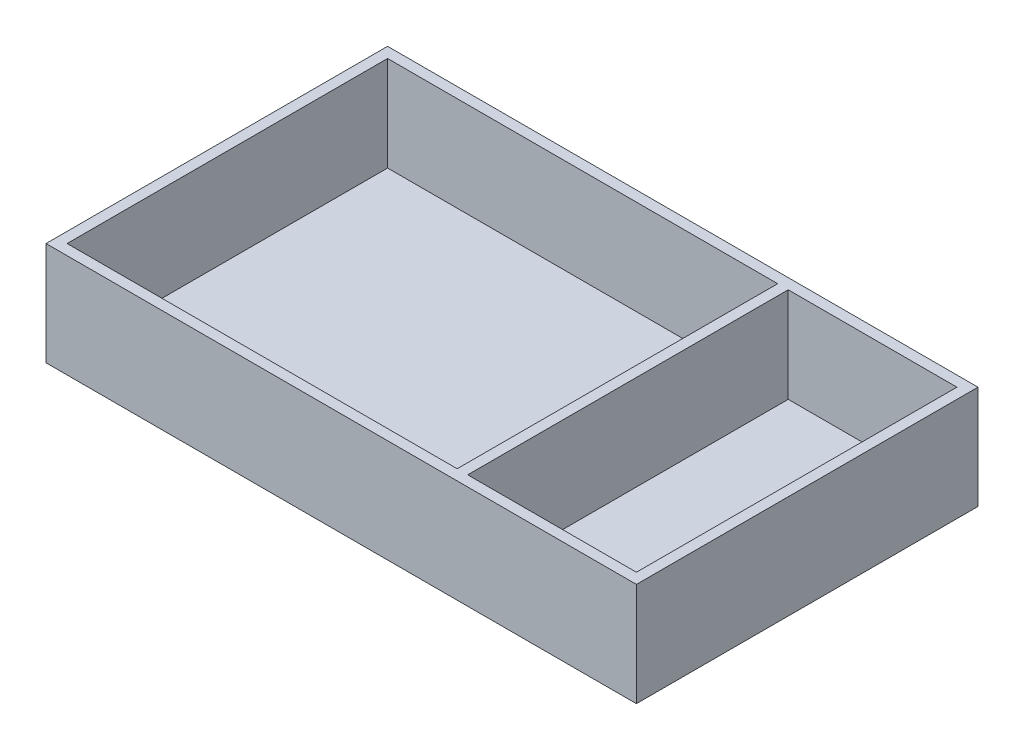
ISO-10303-21;
HEADER;
FILE_DESCRIPTION(('STEP AP214'),'2;1');
FILE_NAME('part.step','',(''),(''),'','','');
FILE_SCHEMA(('AUTOMOTIVE_DESIGN { 1 0 10303 214 1 1 1 1 }'));
ENDSEC;
DATA;
#1=APPLICATION_CONTEXT('core data for automotive mechanical design processes');
#2=APPLICATION_PROTOCOL_DEFINITION('international standard','automotive_design',2000,#1);
#3=PRODUCT_CONTEXT('',#1,'mechanical');
#4=PRODUCT('Part','Part','',(#3));
#5=PRODUCT_RELATED_PRODUCT_CATEGORY('part','',(#4));
#6=PRODUCT_DEFINITION_FORMATION('','',#4);
#7=PRODUCT_DEFINITION_CONTEXT('part definition',#1,'design');
#8=PRODUCT_DEFINITION('design','',#6,#7);
#9=PRODUCT_DEFINITION_SHAPE('','',#8);
#10=(LENGTH_UNIT() NAMED_UNIT(*) SI_UNIT(.MILLI.,.METRE.));
#11=(NAMED_UNIT(*) PLANE_ANGLE_UNIT() SI_UNIT($,.RADIAN.));
#12=(NAMED_UNIT(*) SI_UNIT($,.STERADIAN.) SOLID_ANGLE_UNIT());
#13=UNCERTAINTY_MEASURE_WITH_UNIT(LENGTH_MEASURE(1.E-05),#10,'distance_accuracy_value','');
#14=(GEOMETRIC_REPRESENTATION_CONTEXT(3) GLOBAL_UNCERTAINTY_ASSIGNED_CONTEXT((#13)) GLOBAL_UNIT_ASSIGNED_CONTEXT((#10,
#11,#12)) REPRESENTATION_CONTEXT('',''));
#15=CARTESIAN_POINT('',(0.,0.,0.));
#16=DIRECTION('',(0.,0.,1.));
#17=DIRECTION('',(1.,0.,0.));
#18=AXIS2_PLACEMENT_3D('',#15,#16,#17);
#19=CARTESIAN_POINT('',(-135.,45.,-76.));
#20=DIRECTION('',(0.,0.,1.));
#21=DIRECTION('',(1.,0.,0.));
#22=AXIS2_PLACEMENT_3D('',#19,#20,#21);
#23=PLANE('',#22);
#24=DIRECTION('',(-1.,0.,0.));
#25=VECTOR('',#24,1.);
#26=CARTESIAN_POINT('',(-135.,45.,-76.));
#27=LINE('',#26,#25);
#28=CARTESIAN_POINT('',(135.,45.,-76.));
#29=VERTEX_POINT('',#28);
#30=CARTESIAN_POINT('',(55.,45.,-76.));
#31=VERTEX_POINT('',#30);
#32=EDGE_CURVE('E67',#29,#31,#27,.T.);
#33=ORIENTED_EDGE('',*,*,#32,.T.);
#34=DIRECTION('',(0.,-1.,0.));
#35=VECTOR('',#34,1.);
#36=CARTESIAN_POINT('',(55.,45.,-76.));
#37=LINE('',#36,#35);
#38=CARTESIAN_POINT('',(55.,0.,-76.));
#39=VERTEX_POINT('',#38);
#40=EDGE_CURVE('E175',#31,#39,#37,.T.);
#41=ORIENTED_EDGE('',*,*,#40,.T.);
#42=DIRECTION('',(-1.,0.,0.));
#43=VECTOR('',#42,1.);
#44=CARTESIAN_POINT('',(-135.,0.,-76.));
#45=LINE('',#44,#43);
#46=CARTESIAN_POINT('',(135.,0.,-76.));
#47=VERTEX_POINT('',#46);
#48=EDGE_CURVE('E212',#47,#39,#45,.T.);
#49=ORIENTED_EDGE('',*,*,#48,.F.);
#50=DIRECTION('',(0.,-1.,0.));
#51=VECTOR('',#50,1.);
#52=CARTESIAN_POINT('',(135.,45.,-76.));
#53=LINE('',#52,#51);
#54=EDGE_CURVE('E228',#29,#47,#53,.T.);
#55=ORIENTED_EDGE('',*,*,#54,.F.);
#56=EDGE_LOOP('',(#33,#41,#49,#55));
#57=FACE_BOUND('',#56,.T.);
#58=ADVANCED_FACE('F43',(#57),#23,.T.);
#59=CARTESIAN_POINT('',(50.,0.,-76.));
#60=VERTEX_POINT('',#59);
#61=CARTESIAN_POINT('',(-135.,0.,-76.));
#62=VERTEX_POINT('',#61);
#63=EDGE_CURVE('E211',#60,#62,#45,.T.);
#64=ORIENTED_EDGE('',*,*,#63,.F.);
#65=DIRECTION('',(0.,-1.,0.));
#66=VECTOR('',#65,1.);
#67=CARTESIAN_POINT('',(50.,45.,-76.));
#68=LINE('',#67,#66);
#69=CARTESIAN_POINT('',(50.,45.,-76.));
#70=VERTEX_POINT('',#69);
#71=EDGE_CURVE('E59',#70,#60,#68,.T.);
#72=ORIENTED_EDGE('',*,*,#71,.F.);
#73=CARTESIAN_POINT('',(-135.,45.,-76.));
#74=VERTEX_POINT('',#73);
#75=EDGE_CURVE('E197',#70,#74,#27,.T.);
#76=ORIENTED_EDGE('',*,*,#75,.T.);
#77=DIRECTION('',(0.,-1.,0.));
#78=VECTOR('',#77,1.);
#79=CARTESIAN_POINT('',(-135.,45.,-76.));
#80=LINE('',#79,#78);
#81=EDGE_CURVE('E224',#74,#62,#80,.T.);
#82=ORIENTED_EDGE('',*,*,#81,.T.);
#83=EDGE_LOOP('',(#64,#72,#76,#82));
#84=FACE_BOUND('',#83,.T.);
#85=ADVANCED_FACE('F282',(#84),#23,.T.);
#86=CARTESIAN_POINT('',(-135.,45.,76.));
#87=DIRECTION('',(0.,0.,-1.));
#88=DIRECTION('',(-1.,0.,0.));
#89=AXIS2_PLACEMENT_3D('',#86,#87,#88);
#90=PLANE('',#89);
#91=DIRECTION('',(1.,0.,0.));
#92=VECTOR('',#91,1.);
#93=CARTESIAN_POINT('',(-135.,0.,76.));
#94=LINE('',#93,#92);
#95=CARTESIAN_POINT('',(55.,0.,76.));
#96=VERTEX_POINT('',#95);
#97=CARTESIAN_POINT('',(135.,0.,76.));
#98=VERTEX_POINT('',#97);
#99=EDGE_CURVE('E144',#96,#98,#94,.T.);
#100=ORIENTED_EDGE('',*,*,#99,.F.);
#101=DIRECTION('',(0.,-1.,0.));
#102=VECTOR('',#101,1.);
#103=CARTESIAN_POINT('',(55.,45.,76.));
#104=LINE('',#103,#102);
#105=CARTESIAN_POINT('',(55.,45.,76.));
#106=VERTEX_POINT('',#105);
#107=EDGE_CURVE('E155',#106,#96,#104,.T.);
#108=ORIENTED_EDGE('',*,*,#107,.F.);
#109=DIRECTION('',(1.,0.,0.));
#110=VECTOR('',#109,1.);
#111=CARTESIAN_POINT('',(-135.,45.,76.));
#112=LINE('',#111,#110);
#113=CARTESIAN_POINT('',(135.,45.,76.));
#114=VERTEX_POINT('',#113);
#115=EDGE_CURVE('E204',#106,#114,#112,.T.);
#116=ORIENTED_EDGE('',*,*,#115,.T.);
#117=DIRECTION('',(0.,-1.,0.));
#118=VECTOR('',#117,1.);
#119=CARTESIAN_POINT('',(135.,45.,76.));
#120=LINE('',#119,#118);
#121=EDGE_CURVE('E207',#114,#98,#120,.T.);
#122=ORIENTED_EDGE('',*,*,#121,.T.);
#123=EDGE_LOOP('',(#100,#108,#116,#122));
#124=FACE_BOUND('',#123,.T.);
#125=ADVANCED_FACE('F287',(#124),#90,.T.);
#126=CARTESIAN_POINT('',(-135.,45.,76.));
#127=VERTEX_POINT('',#126);
#128=CARTESIAN_POINT('',(50.,45.,76.));
#129=VERTEX_POINT('',#128);
#130=EDGE_CURVE('E150',#127,#129,#112,.T.);
#131=ORIENTED_EDGE('',*,*,#130,.T.);
#132=DIRECTION('',(0.,-1.,0.));
#133=VECTOR('',#132,1.);
#134=CARTESIAN_POINT('',(50.,45.,76.));
#135=LINE('',#134,#133);
#136=CARTESIAN_POINT('',(50.,0.,76.));
#137=VERTEX_POINT('',#136);
#138=EDGE_CURVE('E147',#129,#137,#135,.T.);
#139=ORIENTED_EDGE('',*,*,#138,.T.);
#140=CARTESIAN_POINT('',(-135.,0.,76.));
#141=VERTEX_POINT('',#140);
#142=EDGE_CURVE('E133',#141,#137,#94,.T.);
#143=ORIENTED_EDGE('',*,*,#142,.F.);
#144=DIRECTION('',(0.,-1.,0.));
#145=VECTOR('',#144,1.);
#146=CARTESIAN_POINT('',(-135.,45.,76.));
#147=LINE('',#146,#145);
#148=EDGE_CURVE('E221',#127,#141,#147,.T.);
#149=ORIENTED_EDGE('',*,*,#148,.F.);
#150=EDGE_LOOP('',(#131,#139,#143,#149));
#151=FACE_BOUND('',#150,.T.);
#152=ADVANCED_FACE('F148',(#151),#90,.T.);
#153=CARTESIAN_POINT('',(0.,0.,0.));
#154=DIRECTION('',(0.,-1.,0.));
#155=DIRECTION('',(0.,0.,-1.));
#156=AXIS2_PLACEMENT_3D('',#153,#154,#155);
#157=PLANE('',#156);
#158=DIRECTION('',(0.,0.,-1.));
#159=VECTOR('',#158,1.);
#160=CARTESIAN_POINT('',(55.,0.,-76.));
#161=LINE('',#160,#159);
#162=EDGE_CURVE('E160',#96,#39,#161,.T.);
#163=ORIENTED_EDGE('',*,*,#162,.F.);
#164=ORIENTED_EDGE('',*,*,#99,.T.);
#165=DIRECTION('',(0.,0.,-1.));
#166=VECTOR('',#165,1.);
#167=CARTESIAN_POINT('',(135.,0.,76.));
#168=LINE('',#167,#166);
#169=EDGE_CURVE('E194',#98,#47,#168,.T.);
#170=ORIENTED_EDGE('',*,*,#169,.T.);
#171=ORIENTED_EDGE('',*,*,#48,.T.);
#172=EDGE_LOOP('',(#163,#164,#170,#171));
#173=FACE_BOUND('',#172,.T.);
#174=ADVANCED_FACE('F383',(#173),#157,.F.);
#175=DIRECTION('',(0.,0.,1.));
#176=VECTOR('',#175,1.);
#177=CARTESIAN_POINT('',(50.,0.,-76.));
#178=LINE('',#177,#176);
#179=EDGE_CURVE('E137',#60,#137,#178,.T.);
#180=ORIENTED_EDGE('',*,*,#179,.F.);
#181=ORIENTED_EDGE('',*,*,#63,.T.);
#182=DIRECTION('',(0.,0.,1.));
#183=VECTOR('',#182,1.);
#184=CARTESIAN_POINT('',(-135.,0.,76.));
#185=LINE('',#184,#183);
#186=EDGE_CURVE('E139',#62,#141,#185,.T.);
#187=ORIENTED_EDGE('',*,*,#186,.T.);
#188=ORIENTED_EDGE('',*,*,#142,.T.);
#189=EDGE_LOOP('',(#180,#181,#187,#188));
#190=FACE_BOUND('',#189,.T.);
#191=ADVANCED_FACE('F135',(#190),#157,.F.);
#192=CARTESIAN_POINT('',(0.,45.,0.));
#193=DIRECTION('',(0.,-1.,0.));
#194=DIRECTION('',(0.,0.,-1.));
#195=AXIS2_PLACEMENT_3D('',#192,#193,#194);
#196=PLANE('',#195);
#197=ORIENTED_EDGE('',*,*,#75,.F.);
#198=DIRECTION('',(0.,0.,1.));
#199=VECTOR('',#198,1.);
#200=CARTESIAN_POINT('',(50.,45.,-76.));
#201=LINE('',#200,#199);
#202=EDGE_CURVE('E164',#70,#129,#201,.T.);
#203=ORIENTED_EDGE('',*,*,#202,.T.);
#204=ORIENTED_EDGE('',*,*,#130,.F.);
#205=DIRECTION('',(0.,0.,1.));
#206=VECTOR('',#205,1.);
#207=CARTESIAN_POINT('',(-135.,45.,76.));
#208=LINE('',#207,#206);
#209=EDGE_CURVE('E200',#74,#127,#208,.T.);
#210=ORIENTED_EDGE('',*,*,#209,.F.);
#211=EDGE_LOOP('',(#197,#203,#204,#210));
#212=FACE_BOUND('',#211,.T.);
#213=DIRECTION('',(0.,0.,-1.));
#214=VECTOR('',#213,1.);
#215=CARTESIAN_POINT('',(140.,45.,81.));
#216=LINE('',#215,#214);
#217=CARTESIAN_POINT('',(140.,45.,81.));
#218=VERTEX_POINT('',#217);
#219=CARTESIAN_POINT('',(140.,45.,-81.));
#220=VERTEX_POINT('',#219);
#221=EDGE_CURVE('E232',#218,#220,#216,.T.);
#222=ORIENTED_EDGE('',*,*,#221,.T.);
#223=DIRECTION('',(-1.,0.,0.));
#224=VECTOR('',#223,1.);
#225=CARTESIAN_POINT('',(-140.,45.,-81.));
#226=LINE('',#225,#224);
#227=CARTESIAN_POINT('',(-140.,45.,-81.));
#228=VERTEX_POINT('',#227);
#229=EDGE_CURVE('E236',#220,#228,#226,.T.);
#230=ORIENTED_EDGE('',*,*,#229,.T.);
#231=DIRECTION('',(0.,0.,1.));
#232=VECTOR('',#231,1.);
#233=CARTESIAN_POINT('',(-140.,45.,81.));
#234=LINE('',#233,#232);
#235=CARTESIAN_POINT('',(-140.,45.,81.));
#236=VERTEX_POINT('',#235);
#237=EDGE_CURVE('E239',#228,#236,#234,.T.);
#238=ORIENTED_EDGE('',*,*,#237,.T.);
#239=DIRECTION('',(1.,0.,0.));
#240=VECTOR('',#239,1.);
#241=CARTESIAN_POINT('',(-140.,45.,81.));
#242=LINE('',#241,#240);
#243=EDGE_CURVE('E242',#236,#218,#242,.T.);
#244=ORIENTED_EDGE('',*,*,#243,.T.);
#245=EDGE_LOOP('',(#222,#230,#238,#244));
#246=FACE_BOUND('',#245,.T.);
#247=DIRECTION('',(0.,0.,-1.));
#248=VECTOR('',#247,1.);
#249=CARTESIAN_POINT('',(135.,45.,76.));
#250=LINE('',#249,#248);
#251=EDGE_CURVE('E143',#114,#29,#250,.T.);
#252=ORIENTED_EDGE('',*,*,#251,.F.);
#253=ORIENTED_EDGE('',*,*,#115,.F.);
#254=DIRECTION('',(0.,0.,-1.));
#255=VECTOR('',#254,1.);
#256=CARTESIAN_POINT('',(55.,45.,-76.));
#257=LINE('',#256,#255);
#258=EDGE_CURVE('E159',#106,#31,#257,.T.);
#259=ORIENTED_EDGE('',*,*,#258,.T.);
#260=ORIENTED_EDGE('',*,*,#32,.F.);
#261=EDGE_LOOP('',(#252,#253,#259,#260));
#262=FACE_BOUND('',#261,.T.);
#263=ADVANCED_FACE('F271',(#212,#246,#262),#196,.F.);
#264=CARTESIAN_POINT('',(140.,45.,81.));
#265=DIRECTION('',(-1.,0.,0.));
#266=DIRECTION('',(0.,0.,1.));
#267=AXIS2_PLACEMENT_3D('',#264,#265,#266);
#268=PLANE('',#267);
#269=DIRECTION('',(0.,-1.,0.));
#270=VECTOR('',#269,1.);
#271=CARTESIAN_POINT('',(140.,45.,81.));
#272=LINE('',#271,#270);
#273=CARTESIAN_POINT('',(140.,-4.,81.));
#274=VERTEX_POINT('',#273);
#275=EDGE_CURVE('E245',#218,#274,#272,.T.);
#276=ORIENTED_EDGE('',*,*,#275,.T.);
#277=DIRECTION('',(0.,0.,1.));
#278=VECTOR('',#277,1.);
#279=CARTESIAN_POINT('',(140.,-4.,81.));
#280=LINE('',#279,#278);
#281=CARTESIAN_POINT('',(140.,-4.,-81.));
#282=VERTEX_POINT('',#281);
#283=EDGE_CURVE('E186',#282,#274,#280,.T.);
#284=ORIENTED_EDGE('',*,*,#283,.F.);
#285=DIRECTION('',(0.,-1.,0.));
#286=VECTOR('',#285,1.);
#287=CARTESIAN_POINT('',(140.,45.,-81.));
#288=LINE('',#287,#286);
#289=EDGE_CURVE('E11',#220,#282,#288,.T.);
#290=ORIENTED_EDGE('',*,*,#289,.F.);
#291=ORIENTED_EDGE('',*,*,#221,.F.);
#292=EDGE_LOOP('',(#276,#284,#290,#291));
#293=FACE_BOUND('',#292,.T.);
#294=ADVANCED_FACE('F45',(#293),#268,.F.);
#295=CARTESIAN_POINT('',(-140.,45.,-81.));
#296=DIRECTION('',(0.,0.,1.));
#297=DIRECTION('',(1.,0.,0.));
#298=AXIS2_PLACEMENT_3D('',#295,#296,#297);
#299=PLANE('',#298);
#300=ORIENTED_EDGE('',*,*,#289,.T.);
#301=DIRECTION('',(1.,0.,0.));
#302=VECTOR('',#301,1.);
#303=CARTESIAN_POINT('',(-140.,-4.,-81.));
#304=LINE('',#303,#302);
#305=CARTESIAN_POINT('',(-140.,-4.,-81.));
#306=VERTEX_POINT('',#305);
#307=EDGE_CURVE('E182',#306,#282,#304,.T.);
#308=ORIENTED_EDGE('',*,*,#307,.F.);
#309=DIRECTION('',(0.,-1.,0.));
#310=VECTOR('',#309,1.);
#311=CARTESIAN_POINT('',(-140.,45.,-81.));
#312=LINE('',#311,#310);
#313=EDGE_CURVE('E52',#228,#306,#312,.T.);
#314=ORIENTED_EDGE('',*,*,#313,.F.);
#315=ORIENTED_EDGE('',*,*,#229,.F.);
#316=EDGE_LOOP('',(#300,#308,#314,#315));
#317=FACE_BOUND('',#316,.T.);
#318=ADVANCED_FACE('F259',(#317),#299,.F.);
#319=CARTESIAN_POINT('',(-140.,45.,81.));
#320=DIRECTION('',(1.,0.,0.));
#321=DIRECTION('',(0.,0.,-1.));
#322=AXIS2_PLACEMENT_3D('',#319,#320,#321);
#323=PLANE('',#322);
#324=ORIENTED_EDGE('',*,*,#313,.T.);
#325=DIRECTION('',(0.,0.,-1.));
#326=VECTOR('',#325,1.);
#327=CARTESIAN_POINT('',(-140.,-4.,81.));
#328=LINE('',#327,#326);
#329=CARTESIAN_POINT('',(-140.,-4.,81.));
#330=VERTEX_POINT('',#329);
#331=EDGE_CURVE('E178',#330,#306,#328,.T.);
#332=ORIENTED_EDGE('',*,*,#331,.F.);
#333=DIRECTION('',(0.,-1.,0.));
#334=VECTOR('',#333,1.);
#335=CARTESIAN_POINT('',(-140.,45.,81.));
#336=LINE('',#335,#334);
#337=EDGE_CURVE('E248',#236,#330,#336,.T.);
#338=ORIENTED_EDGE('',*,*,#337,.F.);
#339=ORIENTED_EDGE('',*,*,#237,.F.);
#340=EDGE_LOOP('',(#324,#332,#338,#339));
#341=FACE_BOUND('',#340,.T.);
#342=ADVANCED_FACE('F256',(#341),#323,.F.);
#343=CARTESIAN_POINT('',(-140.,45.,81.));
#344=DIRECTION('',(0.,0.,-1.));
#345=DIRECTION('',(-1.,0.,0.));
#346=AXIS2_PLACEMENT_3D('',#343,#344,#345);
#347=PLANE('',#346);
#348=ORIENTED_EDGE('',*,*,#337,.T.);
#349=DIRECTION('',(-1.,0.,0.));
#350=VECTOR('',#349,1.);
#351=CARTESIAN_POINT('',(-140.,-4.,81.));
#352=LINE('',#351,#350);
#353=EDGE_CURVE('E190',#274,#330,#352,.T.);
#354=ORIENTED_EDGE('',*,*,#353,.F.);
#355=ORIENTED_EDGE('',*,*,#275,.F.);
#356=ORIENTED_EDGE('',*,*,#243,.F.);
#357=EDGE_LOOP('',(#348,#354,#355,#356));
#358=FACE_BOUND('',#357,.T.);
#359=ADVANCED_FACE('F267',(#358),#347,.F.);
#360=CARTESIAN_POINT('',(135.,45.,76.));
#361=DIRECTION('',(-1.,0.,0.));
#362=DIRECTION('',(0.,0.,1.));
#363=AXIS2_PLACEMENT_3D('',#360,#361,#362);
#364=PLANE('',#363);
#365=ORIENTED_EDGE('',*,*,#169,.F.);
#366=ORIENTED_EDGE('',*,*,#121,.F.);
#367=ORIENTED_EDGE('',*,*,#251,.T.);
#368=ORIENTED_EDGE('',*,*,#54,.T.);
#369=EDGE_LOOP('',(#365,#366,#367,#368));
#370=FACE_BOUND('',#369,.T.);
#371=ADVANCED_FACE('F292',(#370),#364,.T.);
#372=CARTESIAN_POINT('',(-135.,45.,76.));
#373=DIRECTION('',(1.,0.,0.));
#374=DIRECTION('',(0.,0.,-1.));
#375=AXIS2_PLACEMENT_3D('',#372,#373,#374);
#376=PLANE('',#375);
#377=ORIENTED_EDGE('',*,*,#186,.F.);
#378=ORIENTED_EDGE('',*,*,#81,.F.);
#379=ORIENTED_EDGE('',*,*,#209,.T.);
#380=ORIENTED_EDGE('',*,*,#148,.T.);
#381=EDGE_LOOP('',(#377,#378,#379,#380));
#382=FACE_BOUND('',#381,.T.);
#383=ADVANCED_FACE('F290',(#382),#376,.T.);
#384=CARTESIAN_POINT('',(0.,-4.,0.));
#385=DIRECTION('',(0.,-1.,0.));
#386=DIRECTION('',(0.,0.,-1.));
#387=AXIS2_PLACEMENT_3D('',#384,#385,#386);
#388=PLANE('',#387);
#389=ORIENTED_EDGE('',*,*,#331,.T.);
#390=ORIENTED_EDGE('',*,*,#307,.T.);
#391=ORIENTED_EDGE('',*,*,#283,.T.);
#392=ORIENTED_EDGE('',*,*,#353,.T.);
#393=EDGE_LOOP('',(#389,#390,#391,#392));
#394=FACE_BOUND('',#393,.T.);
#395=ADVANCED_FACE('F263',(#394),#388,.T.);
#396=CARTESIAN_POINT('',(55.,45.,-76.));
#397=DIRECTION('',(-1.,0.,0.));
#398=DIRECTION('',(0.,0.,1.));
#399=AXIS2_PLACEMENT_3D('',#396,#397,#398);
#400=PLANE('',#399);
#401=ORIENTED_EDGE('',*,*,#162,.T.);
#402=ORIENTED_EDGE('',*,*,#40,.F.);
#403=ORIENTED_EDGE('',*,*,#258,.F.);
#404=ORIENTED_EDGE('',*,*,#107,.T.);
#405=EDGE_LOOP('',(#401,#402,#403,#404));
#406=FACE_BOUND('',#405,.T.);
#407=ADVANCED_FACE('F323',(#406),#400,.F.);
#408=CARTESIAN_POINT('',(50.,45.,-76.));
#409=DIRECTION('',(1.,0.,0.));
#410=DIRECTION('',(0.,0.,-1.));
#411=AXIS2_PLACEMENT_3D('',#408,#409,#410);
#412=PLANE('',#411);
#413=ORIENTED_EDGE('',*,*,#179,.T.);
#414=ORIENTED_EDGE('',*,*,#138,.F.);
#415=ORIENTED_EDGE('',*,*,#202,.F.);
#416=ORIENTED_EDGE('',*,*,#71,.T.);
#417=EDGE_LOOP('',(#413,#414,#415,#416));
#418=FACE_BOUND('',#417,.T.);
#419=ADVANCED_FACE('F157',(#418),#412,.F.);
#420=CLOSED_SHELL('',(#58,#85,#125,#152,#174,#191,#263,#294,#318,#342,#359,#371,#383,#395,#407,#419));
#421=MANIFOLD_SOLID_BREP('B2',#420);
#422=ADVANCED_BREP_SHAPE_REPRESENTATION('',(#18,#421),#14);
#423=SHAPE_DEFINITION_REPRESENTATION(#9,#422);
ENDSEC;
END-ISO-10303-21;
